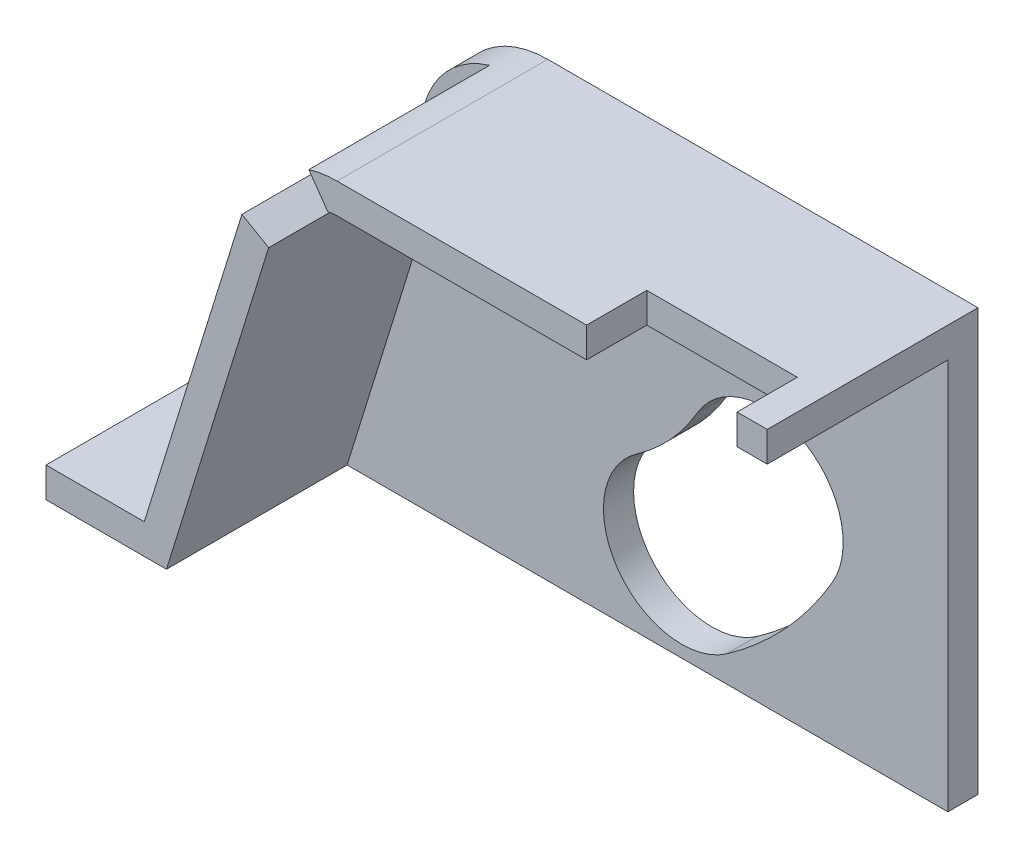
ISO-10303-21;
HEADER;
FILE_DESCRIPTION(('STEP AP214'),'2;1');
FILE_NAME('part.step','',(''),(''),'','','');
FILE_SCHEMA(('AUTOMOTIVE_DESIGN { 1 0 10303 214 1 1 1 1 }'));
ENDSEC;
DATA;
#1=APPLICATION_CONTEXT('core data for automotive mechanical design processes');
#2=APPLICATION_PROTOCOL_DEFINITION('international standard','automotive_design',2000,#1);
#3=PRODUCT_CONTEXT('',#1,'mechanical');
#4=PRODUCT('Part','Part','',(#3));
#5=PRODUCT_RELATED_PRODUCT_CATEGORY('part','',(#4));
#6=PRODUCT_DEFINITION_FORMATION('','',#4);
#7=PRODUCT_DEFINITION_CONTEXT('part definition',#1,'design');
#8=PRODUCT_DEFINITION('design','',#6,#7);
#9=PRODUCT_DEFINITION_SHAPE('','',#8);
#10=(LENGTH_UNIT() NAMED_UNIT(*) SI_UNIT(.MILLI.,.METRE.));
#11=(NAMED_UNIT(*) PLANE_ANGLE_UNIT() SI_UNIT($,.RADIAN.));
#12=(NAMED_UNIT(*) SI_UNIT($,.STERADIAN.) SOLID_ANGLE_UNIT());
#13=UNCERTAINTY_MEASURE_WITH_UNIT(LENGTH_MEASURE(1.E-05),#10,'distance_accuracy_value','');
#14=(GEOMETRIC_REPRESENTATION_CONTEXT(3) GLOBAL_UNCERTAINTY_ASSIGNED_CONTEXT((#13)) GLOBAL_UNIT_ASSIGNED_CONTEXT((#10,
#11,#12)) REPRESENTATION_CONTEXT('',''));
#15=CARTESIAN_POINT('',(0.,0.,0.));
#16=DIRECTION('',(0.,0.,1.));
#17=DIRECTION('',(1.,0.,0.));
#18=AXIS2_PLACEMENT_3D('',#15,#16,#17);
#19=CARTESIAN_POINT('',(120.,70.,-5.));
#20=DIRECTION('',(0.,-1.,0.));
#21=DIRECTION('',(1.,0.,0.));
#22=AXIS2_PLACEMENT_3D('',#19,#20,#21);
#23=PLANE('',#22);
#24=DIRECTION('',(0.,0.,1.));
#25=VECTOR('',#24,1.);
#26=CARTESIAN_POINT('',(120.,70.,-5.));
#27=LINE('',#26,#25);
#28=CARTESIAN_POINT('',(120.,70.,5.));
#29=VERTEX_POINT('',#28);
#30=CARTESIAN_POINT('',(120.,70.,40.));
#31=VERTEX_POINT('',#30);
#32=EDGE_CURVE('E338',#29,#31,#27,.T.);
#33=ORIENTED_EDGE('',*,*,#32,.F.);
#34=DIRECTION('',(1.,0.,0.));
#35=VECTOR('',#34,1.);
#36=CARTESIAN_POINT('',(0.234832876698648,70.,5.));
#37=LINE('',#36,#35);
#38=CARTESIAN_POINT('',(48.5613886077065,70.,5.));
#39=VERTEX_POINT('',#38);
#40=EDGE_CURVE('E183',#39,#29,#37,.T.);
#41=ORIENTED_EDGE('',*,*,#40,.F.);
#42=DIRECTION('',(0.,0.,1.));
#43=VECTOR('',#42,1.);
#44=CARTESIAN_POINT('',(48.5613886077065,70.,-5.));
#45=LINE('',#44,#43);
#46=CARTESIAN_POINT('',(48.5613886077065,70.,40.));
#47=VERTEX_POINT('',#46);
#48=EDGE_CURVE('E340',#39,#47,#45,.T.);
#49=ORIENTED_EDGE('',*,*,#48,.T.);
#50=DIRECTION('',(1.,0.,0.));
#51=VECTOR('',#50,1.);
#52=CARTESIAN_POINT('',(120.,70.,40.));
#53=LINE('',#52,#51);
#54=CARTESIAN_POINT('',(90.,70.,40.));
#55=VERTEX_POINT('',#54);
#56=EDGE_CURVE('E283',#47,#55,#53,.T.);
#57=ORIENTED_EDGE('',*,*,#56,.T.);
#58=DIRECTION('',(0.,0.,-1.));
#59=VECTOR('',#58,1.);
#60=CARTESIAN_POINT('',(90.,70.,40.));
#61=LINE('',#60,#59);
#62=CARTESIAN_POINT('',(90.,70.,30.));
#63=VERTEX_POINT('',#62);
#64=EDGE_CURVE('E239',#55,#63,#61,.T.);
#65=ORIENTED_EDGE('',*,*,#64,.T.);
#66=DIRECTION('',(1.,0.,0.));
#67=VECTOR('',#66,1.);
#68=CARTESIAN_POINT('',(115.,70.,30.));
#69=LINE('',#68,#67);
#70=CARTESIAN_POINT('',(115.,70.,30.));
#71=VERTEX_POINT('',#70);
#72=EDGE_CURVE('E243',#63,#71,#69,.T.);
#73=ORIENTED_EDGE('',*,*,#72,.T.);
#74=DIRECTION('',(0.,0.,1.));
#75=VECTOR('',#74,1.);
#76=CARTESIAN_POINT('',(115.,70.,40.));
#77=LINE('',#76,#75);
#78=CARTESIAN_POINT('',(115.,70.,40.));
#79=VERTEX_POINT('',#78);
#80=EDGE_CURVE('E237',#71,#79,#77,.T.);
#81=ORIENTED_EDGE('',*,*,#80,.T.);
#82=EDGE_CURVE('E281',#79,#31,#53,.T.);
#83=ORIENTED_EDGE('',*,*,#82,.T.);
#84=EDGE_LOOP('',(#33,#41,#49,#57,#65,#73,#81,#83));
#85=FACE_BOUND('',#84,.T.);
#86=ADVANCED_FACE('F33',(#85),#23,.F.);
#87=CARTESIAN_POINT('',(120.,65.,40.));
#88=DIRECTION('',(0.,-1.,0.));
#89=DIRECTION('',(0.,0.,-1.));
#90=AXIS2_PLACEMENT_3D('',#87,#88,#89);
#91=PLANE('',#90);
#92=DIRECTION('',(-1.,0.,0.));
#93=VECTOR('',#92,1.);
#94=CARTESIAN_POINT('',(120.,65.,40.));
#95=LINE('',#94,#93);
#96=CARTESIAN_POINT('',(120.,65.,40.));
#97=VERTEX_POINT('',#96);
#98=CARTESIAN_POINT('',(115.,65.,40.));
#99=VERTEX_POINT('',#98);
#100=EDGE_CURVE('E296',#97,#99,#95,.T.);
#101=ORIENTED_EDGE('',*,*,#100,.T.);
#102=DIRECTION('',(0.,0.,-1.));
#103=VECTOR('',#102,1.);
#104=CARTESIAN_POINT('',(115.,65.,40.));
#105=LINE('',#104,#103);
#106=CARTESIAN_POINT('',(115.,65.,30.));
#107=VERTEX_POINT('',#106);
#108=EDGE_CURVE('E224',#99,#107,#105,.T.);
#109=ORIENTED_EDGE('',*,*,#108,.T.);
#110=DIRECTION('',(-1.,0.,0.));
#111=VECTOR('',#110,1.);
#112=CARTESIAN_POINT('',(120.,65.,30.));
#113=LINE('',#112,#111);
#114=CARTESIAN_POINT('',(90.,65.,30.));
#115=VERTEX_POINT('',#114);
#116=EDGE_CURVE('E41',#107,#115,#113,.T.);
#117=ORIENTED_EDGE('',*,*,#116,.T.);
#118=DIRECTION('',(0.,0.,1.));
#119=VECTOR('',#118,1.);
#120=CARTESIAN_POINT('',(90.,65.,40.));
#121=LINE('',#120,#119);
#122=CARTESIAN_POINT('',(90.,65.,40.));
#123=VERTEX_POINT('',#122);
#124=EDGE_CURVE('E222',#115,#123,#121,.T.);
#125=ORIENTED_EDGE('',*,*,#124,.T.);
#126=CARTESIAN_POINT('',(48.5613886077065,65.,40.));
#127=VERTEX_POINT('',#126);
#128=EDGE_CURVE('E295',#123,#127,#95,.T.);
#129=ORIENTED_EDGE('',*,*,#128,.T.);
#130=DIRECTION('',(0.,0.,-1.));
#131=VECTOR('',#130,1.);
#132=CARTESIAN_POINT('',(48.5613886077065,65.,40.));
#133=LINE('',#132,#131);
#134=CARTESIAN_POINT('',(48.5613886077065,65.,10.));
#135=VERTEX_POINT('',#134);
#136=EDGE_CURVE('E307',#127,#135,#133,.T.);
#137=ORIENTED_EDGE('',*,*,#136,.T.);
#138=DIRECTION('',(-1.,0.,0.));
#139=VECTOR('',#138,1.);
#140=CARTESIAN_POINT('',(120.,65.,10.));
#141=LINE('',#140,#139);
#142=CARTESIAN_POINT('',(120.,65.,10.));
#143=VERTEX_POINT('',#142);
#144=EDGE_CURVE('E282',#143,#135,#141,.T.);
#145=ORIENTED_EDGE('',*,*,#144,.F.);
#146=DIRECTION('',(0.,0.,-1.));
#147=VECTOR('',#146,1.);
#148=CARTESIAN_POINT('',(120.,65.,40.));
#149=LINE('',#148,#147);
#150=EDGE_CURVE('E298',#97,#143,#149,.T.);
#151=ORIENTED_EDGE('',*,*,#150,.F.);
#152=EDGE_LOOP('',(#101,#109,#117,#125,#129,#137,#145,#151));
#153=FACE_BOUND('',#152,.T.);
#154=ADVANCED_FACE('F221',(#153),#91,.T.);
#155=CARTESIAN_POINT('',(48.5613886077065,58.9097221037272,40.));
#156=DIRECTION('',(0.,0.,-1.));
#157=DIRECTION('',(1.,0.,0.));
#158=AXIS2_PLACEMENT_3D('',#155,#156,#157);
#159=PLANE('',#158);
#160=DIRECTION('',(0.,1.,0.));
#161=VECTOR('',#160,1.);
#162=CARTESIAN_POINT('',(115.,58.9097221037273,40.));
#163=LINE('',#162,#161);
#164=EDGE_CURVE('E215',#99,#79,#163,.T.);
#165=ORIENTED_EDGE('',*,*,#164,.F.);
#166=ORIENTED_EDGE('',*,*,#100,.F.);
#167=DIRECTION('',(0.,-1.,0.));
#168=VECTOR('',#167,1.);
#169=CARTESIAN_POINT('',(120.,70.,40.));
#170=LINE('',#169,#168);
#171=EDGE_CURVE('E278',#31,#97,#170,.T.);
#172=ORIENTED_EDGE('',*,*,#171,.F.);
#173=ORIENTED_EDGE('',*,*,#82,.F.);
#174=EDGE_LOOP('',(#165,#166,#172,#173));
#175=FACE_BOUND('',#174,.T.);
#176=ADVANCED_FACE('F399',(#175),#159,.F.);
#177=DIRECTION('',(0.,-1.,0.));
#178=VECTOR('',#177,1.);
#179=CARTESIAN_POINT('',(90.,58.9097221037273,40.));
#180=LINE('',#179,#178);
#181=EDGE_CURVE('E213',#55,#123,#180,.T.);
#182=ORIENTED_EDGE('',*,*,#181,.F.);
#183=ORIENTED_EDGE('',*,*,#56,.F.);
#184=CARTESIAN_POINT('',(48.5613886077065,53.9097221037275,40.));
#185=DIRECTION('',(0.,0.,-1.));
#186=DIRECTION('',(1.,0.,0.));
#187=AXIS2_PLACEMENT_3D('',#184,#185,#186);
#188=CIRCLE('',#187,16.0902778962725);
#189=CARTESIAN_POINT('',(43.8850469520508,69.3054640962024,40.));
#190=VERTEX_POINT('',#189);
#191=EDGE_CURVE('E286',#190,#47,#188,.T.);
#192=ORIENTED_EDGE('',*,*,#191,.F.);
#193=DIRECTION('',(-0.573576436351043,0.819152044288994,0.));
#194=VECTOR('',#193,1.);
#195=CARTESIAN_POINT('',(47.0357374309038,64.8058117689672,40.));
#196=LINE('',#195,#194);
#197=CARTESIAN_POINT('',(47.0357374309038,64.8058117689672,40.));
#198=VERTEX_POINT('',#197);
#199=EDGE_CURVE('E289',#198,#190,#196,.T.);
#200=ORIENTED_EDGE('',*,*,#199,.F.);
#201=CARTESIAN_POINT('',(48.5613886077065,58.9097221037272,40.));
#202=DIRECTION('',(0.,0.,1.));
#203=DIRECTION('',(1.,0.,0.));
#204=AXIS2_PLACEMENT_3D('',#201,#202,#203);
#205=CIRCLE('',#204,6.09027789627276);
#206=EDGE_CURVE('E292',#127,#198,#205,.T.);
#207=ORIENTED_EDGE('',*,*,#206,.F.);
#208=ORIENTED_EDGE('',*,*,#128,.F.);
#209=EDGE_LOOP('',(#182,#183,#192,#200,#207,#208));
#210=FACE_BOUND('',#209,.T.);
#211=ADVANCED_FACE('F385',(#210),#159,.F.);
#212=CARTESIAN_POINT('',(33.1929152722023,58.6749157110409,-5.));
#213=DIRECTION('',(0.9551403297431,-0.296153592749172,0.));
#214=DIRECTION('',(0.296153592749172,0.9551403297431,0.));
#215=AXIS2_PLACEMENT_3D('',#212,#213,#214);
#216=PLANE('',#215);
#217=DIRECTION('',(0.,0.,1.));
#218=VECTOR('',#217,1.);
#219=CARTESIAN_POINT('',(33.1929152722023,58.6749157110409,-5.));
#220=LINE('',#219,#218);
#221=CARTESIAN_POINT('',(33.1929152722023,58.6749157110409,5.));
#222=VERTEX_POINT('',#221);
#223=CARTESIAN_POINT('',(33.1929152722023,58.6749157110409,10.));
#224=VERTEX_POINT('',#223);
#225=EDGE_CURVE('E337',#222,#224,#220,.T.);
#226=ORIENTED_EDGE('',*,*,#225,.F.);
#227=DIRECTION('',(-0.296153592749172,-0.9551403297431,0.));
#228=VECTOR('',#227,1.);
#229=CARTESIAN_POINT('',(33.1929152722023,58.6749157110409,5.));
#230=LINE('',#229,#228);
#231=CARTESIAN_POINT('',(16.5503145638758,5.,5.));
#232=VERTEX_POINT('',#231);
#233=EDGE_CURVE('E415',#222,#232,#230,.T.);
#234=ORIENTED_EDGE('',*,*,#233,.T.);
#235=DIRECTION('',(0.,0.,1.));
#236=VECTOR('',#235,1.);
#237=CARTESIAN_POINT('',(16.5503145638758,5.,-5.));
#238=LINE('',#237,#236);
#239=CARTESIAN_POINT('',(16.5503145638758,5.,40.));
#240=VERTEX_POINT('',#239);
#241=EDGE_CURVE('E334',#232,#240,#238,.T.);
#242=ORIENTED_EDGE('',*,*,#241,.T.);
#243=DIRECTION('',(0.296153592749172,0.9551403297431,0.));
#244=VECTOR('',#243,1.);
#245=CARTESIAN_POINT('',(15.,0.,40.));
#246=LINE('',#245,#244);
#247=CARTESIAN_POINT('',(32.7730020651153,57.320631822882,40.));
#248=VERTEX_POINT('',#247);
#249=EDGE_CURVE('E264',#240,#248,#246,.T.);
#250=ORIENTED_EDGE('',*,*,#249,.T.);
#251=DIRECTION('',(0.,0.,-1.));
#252=VECTOR('',#251,1.);
#253=CARTESIAN_POINT('',(32.7730020651153,57.320631822882,40.));
#254=LINE('',#253,#252);
#255=CARTESIAN_POINT('',(32.7730020651153,57.320631822882,10.));
#256=VERTEX_POINT('',#255);
#257=EDGE_CURVE('E266',#248,#256,#254,.T.);
#258=ORIENTED_EDGE('',*,*,#257,.T.);
#259=DIRECTION('',(-0.296153592749172,-0.9551403297431,0.));
#260=VECTOR('',#259,1.);
#261=CARTESIAN_POINT('',(13.6843957425264,-4.24302360349572,10.));
#262=LINE('',#261,#260);
#263=EDGE_CURVE('E204',#224,#256,#262,.T.);
#264=ORIENTED_EDGE('',*,*,#263,.F.);
#265=EDGE_LOOP('',(#226,#234,#242,#250,#258,#264));
#266=FACE_BOUND('',#265,.T.);
#267=ADVANCED_FACE('F414',(#266),#216,.F.);
#268=CARTESIAN_POINT('',(0.,0.,10.));
#269=DIRECTION('',(0.,0.,1.));
#270=DIRECTION('',(-1.,0.,0.));
#271=AXIS2_PLACEMENT_3D('',#268,#269,#270);
#272=PLANE('',#271);
#273=DIRECTION('',(-0.296153592749173,-0.9551403297431,0.));
#274=VECTOR('',#273,1.);
#275=CARTESIAN_POINT('',(37.2069506060173,54.7376581656054,10.));
#276=LINE('',#275,#274);
#277=CARTESIAN_POINT('',(37.2069506060173,54.7376581656054,10.));
#278=VERTEX_POINT('',#277);
#279=CARTESIAN_POINT('',(20.2348328766987,0.,10.));
#280=VERTEX_POINT('',#279);
#281=EDGE_CURVE('E254',#278,#280,#276,.T.);
#282=ORIENTED_EDGE('',*,*,#281,.T.);
#283=DIRECTION('',(1.,0.,0.));
#284=VECTOR('',#283,1.);
#285=CARTESIAN_POINT('',(0.,0.,10.));
#286=LINE('',#285,#284);
#287=CARTESIAN_POINT('',(120.,0.,10.));
#288=VERTEX_POINT('',#287);
#289=EDGE_CURVE('E329',#280,#288,#286,.T.);
#290=ORIENTED_EDGE('',*,*,#289,.T.);
#291=DIRECTION('',(0.,1.,0.));
#292=VECTOR('',#291,1.);
#293=CARTESIAN_POINT('',(120.,0.,10.));
#294=LINE('',#293,#292);
#295=EDGE_CURVE('E199',#288,#143,#294,.T.);
#296=ORIENTED_EDGE('',*,*,#295,.T.);
#297=ORIENTED_EDGE('',*,*,#144,.T.);
#298=CARTESIAN_POINT('',(48.5613886077065,58.9097221037272,10.));
#299=DIRECTION('',(0.,0.,1.));
#300=DIRECTION('',(1.,0.,0.));
#301=AXIS2_PLACEMENT_3D('',#298,#299,#300);
#302=CIRCLE('',#301,6.09027789627276);
#303=CARTESIAN_POINT('',(47.0357374309038,64.8058117689672,10.));
#304=VERTEX_POINT('',#303);
#305=EDGE_CURVE('E301',#135,#304,#302,.T.);
#306=ORIENTED_EDGE('',*,*,#305,.T.);
#307=DIRECTION('',(-0.573576436351043,0.819152044288994,0.));
#308=VECTOR('',#307,1.);
#309=CARTESIAN_POINT('',(47.0357374309038,64.8058117689672,10.));
#310=LINE('',#309,#308);
#311=CARTESIAN_POINT('',(43.8850469520508,69.3054640962024,10.));
#312=VERTEX_POINT('',#311);
#313=EDGE_CURVE('E277',#304,#312,#310,.T.);
#314=ORIENTED_EDGE('',*,*,#313,.T.);
#315=CARTESIAN_POINT('',(48.5613886077065,53.9097221037271,10.));
#316=DIRECTION('',(0.,0.,1.));
#317=DIRECTION('',(1.,0.,0.));
#318=AXIS2_PLACEMENT_3D('',#315,#316,#317);
#319=CIRCLE('',#318,16.0902778962729);
#320=EDGE_CURVE('E200',#312,#224,#319,.T.);
#321=ORIENTED_EDGE('',*,*,#320,.T.);
#322=ORIENTED_EDGE('',*,*,#263,.T.);
#323=DIRECTION('',(0.864075299099649,-0.503362570604781,0.));
#324=VECTOR('',#323,1.);
#325=CARTESIAN_POINT('',(37.2069506060173,54.7376581656054,10.));
#326=LINE('',#325,#324);
#327=EDGE_CURVE('E258',#256,#278,#326,.T.);
#328=ORIENTED_EDGE('',*,*,#327,.T.);
#329=EDGE_LOOP('',(#282,#290,#296,#297,#306,#314,#321,#322,#328));
#330=FACE_BOUND('',#329,.T.);
#331=CARTESIAN_POINT('',(48.5613886077065,53.9097221037271,10.));
#332=DIRECTION('',(0.,0.,1.));
#333=DIRECTION('',(1.,0.,0.));
#334=AXIS2_PLACEMENT_3D('',#331,#332,#333);
#335=CIRCLE('',#334,60.5);
#336=CARTESIAN_POINT('',(83.2627630069448,4.35102342424313,10.));
#337=VERTEX_POINT('',#336);
#338=CARTESIAN_POINT('',(100.837944203235,23.4562865821378,10.));
#339=VERTEX_POINT('',#338);
#340=EDGE_CURVE('E323',#337,#339,#335,.T.);
#341=ORIENTED_EDGE('',*,*,#340,.F.);
#342=CARTESIAN_POINT('',(75.8062693343812,15.,10.));
#343=DIRECTION('',(0.,0.,1.));
#344=DIRECTION('',(1.,0.,0.));
#345=AXIS2_PLACEMENT_3D('',#342,#343,#344);
#346=CIRCLE('',#345,13.);
#347=CARTESIAN_POINT('',(68.3497756618176,25.6489765757569,10.));
#348=VERTEX_POINT('',#347);
#349=EDGE_CURVE('E314',#348,#337,#346,.T.);
#350=ORIENTED_EDGE('',*,*,#349,.F.);
#351=CARTESIAN_POINT('',(48.5613886077065,53.9097221037271,10.));
#352=DIRECTION('',(0.,0.,-1.));
#353=DIRECTION('',(1.,0.,0.));
#354=AXIS2_PLACEMENT_3D('',#351,#352,#353);
#355=CIRCLE('',#354,34.5);
#356=CARTESIAN_POINT('',(78.3719864266444,36.5437134178622,10.));
#357=VERTEX_POINT('',#356);
#358=EDGE_CURVE('E317',#357,#348,#355,.T.);
#359=ORIENTED_EDGE('',*,*,#358,.F.);
#360=CARTESIAN_POINT('',(89.6049653149398,30.,10.));
#361=DIRECTION('',(0.,0.,1.));
#362=DIRECTION('',(1.,0.,0.));
#363=AXIS2_PLACEMENT_3D('',#360,#361,#362);
#364=CIRCLE('',#363,13.);
#365=EDGE_CURVE('E320',#339,#357,#364,.T.);
#366=ORIENTED_EDGE('',*,*,#365,.F.);
#367=EDGE_LOOP('',(#341,#350,#359,#366));
#368=FACE_BOUND('',#367,.T.);
#369=CARTESIAN_POINT('',(48.5613886077065,53.9097221037271,10.));
#370=DIRECTION('',(0.,0.,1.));
#371=DIRECTION('',(1.,0.,0.));
#372=AXIS2_PLACEMENT_3D('',#369,#370,#371);
#373=CIRCLE('',#372,2.5);
#374=CARTESIAN_POINT('',(51.0613886077065,53.9097221037271,10.));
#375=VERTEX_POINT('',#374);
#376=EDGE_CURVE('E313',#375,#375,#373,.T.);
#377=ORIENTED_EDGE('',*,*,#376,.F.);
#378=EDGE_LOOP('',(#377));
#379=FACE_BOUND('',#378,.T.);
#380=ADVANCED_FACE('F359',(#330,#368,#379),#272,.T.);
#381=CARTESIAN_POINT('',(0.,0.,5.));
#382=DIRECTION('',(0.,1.,0.));
#383=DIRECTION('',(0.,0.,1.));
#384=AXIS2_PLACEMENT_3D('',#381,#382,#383);
#385=PLANE('',#384);
#386=DIRECTION('',(0.,0.,-1.));
#387=VECTOR('',#386,1.);
#388=CARTESIAN_POINT('',(0.234832876698662,0.,5.));
#389=LINE('',#388,#387);
#390=CARTESIAN_POINT('',(0.234832876698662,0.,40.));
#391=VERTEX_POINT('',#390);
#392=CARTESIAN_POINT('',(0.234832876698662,0.,5.));
#393=VERTEX_POINT('',#392);
#394=EDGE_CURVE('E195',#391,#393,#389,.T.);
#395=ORIENTED_EDGE('',*,*,#394,.T.);
#396=DIRECTION('',(1.,0.,0.));
#397=VECTOR('',#396,1.);
#398=CARTESIAN_POINT('',(0.234832876698662,0.,5.));
#399=LINE('',#398,#397);
#400=CARTESIAN_POINT('',(120.,0.,5.));
#401=VERTEX_POINT('',#400);
#402=EDGE_CURVE('E55',#393,#401,#399,.T.);
#403=ORIENTED_EDGE('',*,*,#402,.T.);
#404=DIRECTION('',(0.,0.,-1.));
#405=VECTOR('',#404,1.);
#406=CARTESIAN_POINT('',(120.,0.,5.));
#407=LINE('',#406,#405);
#408=EDGE_CURVE('E192',#288,#401,#407,.T.);
#409=ORIENTED_EDGE('',*,*,#408,.F.);
#410=ORIENTED_EDGE('',*,*,#289,.F.);
#411=DIRECTION('',(0.,0.,-1.));
#412=VECTOR('',#411,1.);
#413=CARTESIAN_POINT('',(20.2348328766987,0.,40.));
#414=LINE('',#413,#412);
#415=CARTESIAN_POINT('',(20.2348328766987,0.,40.));
#416=VERTEX_POINT('',#415);
#417=EDGE_CURVE('E274',#416,#280,#414,.T.);
#418=ORIENTED_EDGE('',*,*,#417,.F.);
#419=DIRECTION('',(-1.,0.,0.));
#420=VECTOR('',#419,1.);
#421=CARTESIAN_POINT('',(20.2348328766987,0.,40.));
#422=LINE('',#421,#420);
#423=EDGE_CURVE('E255',#416,#391,#422,.T.);
#424=ORIENTED_EDGE('',*,*,#423,.T.);
#425=EDGE_LOOP('',(#395,#403,#409,#410,#418,#424));
#426=FACE_BOUND('',#425,.T.);
#427=ADVANCED_FACE('F35',(#426),#385,.F.);
#428=CARTESIAN_POINT('',(120.,0.,5.));
#429=DIRECTION('',(-1.,0.,0.));
#430=DIRECTION('',(0.,-1.,0.));
#431=AXIS2_PLACEMENT_3D('',#428,#429,#430);
#432=PLANE('',#431);
#433=ORIENTED_EDGE('',*,*,#408,.T.);
#434=DIRECTION('',(0.,-1.,0.));
#435=VECTOR('',#434,1.);
#436=CARTESIAN_POINT('',(120.,0.,5.));
#437=LINE('',#436,#435);
#438=EDGE_CURVE('E179',#29,#401,#437,.T.);
#439=ORIENTED_EDGE('',*,*,#438,.F.);
#440=ORIENTED_EDGE('',*,*,#32,.T.);
#441=ORIENTED_EDGE('',*,*,#171,.T.);
#442=ORIENTED_EDGE('',*,*,#150,.T.);
#443=ORIENTED_EDGE('',*,*,#295,.F.);
#444=EDGE_LOOP('',(#433,#439,#440,#441,#442,#443));
#445=FACE_BOUND('',#444,.T.);
#446=ADVANCED_FACE('F197',(#445),#432,.F.);
#447=CARTESIAN_POINT('',(48.5613886077065,53.9097221037271,0.));
#448=DIRECTION('',(0.,0.,1.));
#449=DIRECTION('',(1.,0.,0.));
#450=AXIS2_PLACEMENT_3D('',#447,#448,#449);
#451=CYLINDRICAL_SURFACE('',#450,2.5);
#452=CARTESIAN_POINT('',(48.5613886077065,53.9097221037271,5.));
#453=DIRECTION('',(0.,0.,1.));
#454=DIRECTION('',(1.,0.,0.));
#455=AXIS2_PLACEMENT_3D('',#452,#453,#454);
#456=CIRCLE('',#455,2.5);
#457=CARTESIAN_POINT('',(51.0613886077065,53.9097221037271,5.));
#458=VERTEX_POINT('',#457);
#459=EDGE_CURVE('E369',#458,#458,#456,.F.);
#460=ORIENTED_EDGE('',*,*,#459,.T.);
#461=EDGE_LOOP('',(#460));
#462=FACE_BOUND('',#461,.T.);
#463=ORIENTED_EDGE('',*,*,#376,.T.);
#464=EDGE_LOOP('',(#463));
#465=FACE_BOUND('',#464,.T.);
#466=ADVANCED_FACE('F466',(#462,#465),#451,.F.);
#467=CARTESIAN_POINT('',(75.8062693343812,15.,0.));
#468=DIRECTION('',(0.,0.,1.));
#469=DIRECTION('',(1.,0.,0.));
#470=AXIS2_PLACEMENT_3D('',#467,#468,#469);
#471=CYLINDRICAL_SURFACE('',#470,13.);
#472=DIRECTION('',(0.,0.,1.));
#473=VECTOR('',#472,1.);
#474=CARTESIAN_POINT('',(83.2627630069448,4.35102342424313,0.));
#475=LINE('',#474,#473);
#476=CARTESIAN_POINT('',(83.2627630069448,4.35102342424313,5.));
#477=VERTEX_POINT('',#476);
#478=EDGE_CURVE('E209',#477,#337,#475,.T.);
#479=ORIENTED_EDGE('',*,*,#478,.F.);
#480=CARTESIAN_POINT('',(75.8062693343812,15.,5.));
#481=DIRECTION('',(0.,0.,1.));
#482=DIRECTION('',(1.,0.,0.));
#483=AXIS2_PLACEMENT_3D('',#480,#481,#482);
#484=CIRCLE('',#483,13.);
#485=CARTESIAN_POINT('',(68.3497756618176,25.6489765757569,5.));
#486=VERTEX_POINT('',#485);
#487=EDGE_CURVE('E48',#477,#486,#484,.F.);
#488=ORIENTED_EDGE('',*,*,#487,.T.);
#489=DIRECTION('',(0.,0.,1.));
#490=VECTOR('',#489,1.);
#491=CARTESIAN_POINT('',(68.3497756618176,25.6489765757569,0.));
#492=LINE('',#491,#490);
#493=EDGE_CURVE('E201',#486,#348,#492,.T.);
#494=ORIENTED_EDGE('',*,*,#493,.T.);
#495=ORIENTED_EDGE('',*,*,#349,.T.);
#496=EDGE_LOOP('',(#479,#488,#494,#495));
#497=FACE_BOUND('',#496,.T.);
#498=ADVANCED_FACE('F355',(#497),#471,.F.);
#499=CARTESIAN_POINT('',(48.5613886077065,53.9097221037271,0.));
#500=DIRECTION('',(0.,0.,1.));
#501=DIRECTION('',(1.,0.,0.));
#502=AXIS2_PLACEMENT_3D('',#499,#500,#501);
#503=CYLINDRICAL_SURFACE('',#502,34.5);
#504=ORIENTED_EDGE('',*,*,#493,.F.);
#505=CARTESIAN_POINT('',(48.5613886077065,53.9097221037271,5.));
#506=DIRECTION('',(0.,0.,1.));
#507=DIRECTION('',(1.,0.,0.));
#508=AXIS2_PLACEMENT_3D('',#505,#506,#507);
#509=CIRCLE('',#508,34.5);
#510=CARTESIAN_POINT('',(78.3719864266444,36.5437134178622,5.));
#511=VERTEX_POINT('',#510);
#512=EDGE_CURVE('E367',#486,#511,#509,.T.);
#513=ORIENTED_EDGE('',*,*,#512,.T.);
#514=DIRECTION('',(0.,0.,1.));
#515=VECTOR('',#514,1.);
#516=CARTESIAN_POINT('',(78.3719864266444,36.5437134178622,0.));
#517=LINE('',#516,#515);
#518=EDGE_CURVE('E206',#511,#357,#517,.T.);
#519=ORIENTED_EDGE('',*,*,#518,.T.);
#520=ORIENTED_EDGE('',*,*,#358,.T.);
#521=EDGE_LOOP('',(#504,#513,#519,#520));
#522=FACE_BOUND('',#521,.T.);
#523=ADVANCED_FACE('F366',(#522),#503,.T.);
#524=CARTESIAN_POINT('',(89.6049653149398,30.,0.));
#525=DIRECTION('',(0.,0.,1.));
#526=DIRECTION('',(1.,0.,0.));
#527=AXIS2_PLACEMENT_3D('',#524,#525,#526);
#528=CYLINDRICAL_SURFACE('',#527,13.);
#529=ORIENTED_EDGE('',*,*,#518,.F.);
#530=CARTESIAN_POINT('',(89.6049653149398,30.,5.));
#531=DIRECTION('',(0.,0.,1.));
#532=DIRECTION('',(1.,0.,0.));
#533=AXIS2_PLACEMENT_3D('',#530,#531,#532);
#534=CIRCLE('',#533,13.);
#535=CARTESIAN_POINT('',(100.837944203235,23.4562865821378,5.));
#536=VERTEX_POINT('',#535);
#537=EDGE_CURVE('E363',#511,#536,#534,.F.);
#538=ORIENTED_EDGE('',*,*,#537,.T.);
#539=DIRECTION('',(0.,0.,1.));
#540=VECTOR('',#539,1.);
#541=CARTESIAN_POINT('',(100.837944203235,23.4562865821378,0.));
#542=LINE('',#541,#540);
#543=EDGE_CURVE('E343',#536,#339,#542,.T.);
#544=ORIENTED_EDGE('',*,*,#543,.T.);
#545=ORIENTED_EDGE('',*,*,#365,.T.);
#546=EDGE_LOOP('',(#529,#538,#544,#545));
#547=FACE_BOUND('',#546,.T.);
#548=ADVANCED_FACE('F362',(#547),#528,.F.);
#549=CARTESIAN_POINT('',(48.5613886077065,53.9097221037271,0.));
#550=DIRECTION('',(0.,0.,1.));
#551=DIRECTION('',(1.,0.,0.));
#552=AXIS2_PLACEMENT_3D('',#549,#550,#551);
#553=CYLINDRICAL_SURFACE('',#552,60.5);
#554=ORIENTED_EDGE('',*,*,#543,.F.);
#555=CARTESIAN_POINT('',(48.5613886077065,53.9097221037271,5.));
#556=DIRECTION('',(0.,0.,1.));
#557=DIRECTION('',(1.,0.,0.));
#558=AXIS2_PLACEMENT_3D('',#555,#556,#557);
#559=CIRCLE('',#558,60.5);
#560=EDGE_CURVE('E352',#536,#477,#559,.F.);
#561=ORIENTED_EDGE('',*,*,#560,.T.);
#562=ORIENTED_EDGE('',*,*,#478,.T.);
#563=ORIENTED_EDGE('',*,*,#340,.T.);
#564=EDGE_LOOP('',(#554,#561,#562,#563));
#565=FACE_BOUND('',#564,.T.);
#566=ADVANCED_FACE('F349',(#565),#553,.F.);
#567=CARTESIAN_POINT('',(48.5613886077065,53.9097221037271,-5.));
#568=DIRECTION('',(0.,0.,1.));
#569=DIRECTION('',(1.,0.,0.));
#570=AXIS2_PLACEMENT_3D('',#567,#568,#569);
#571=CYLINDRICAL_SURFACE('',#570,16.0902778962729);
#572=ORIENTED_EDGE('',*,*,#48,.F.);
#573=CARTESIAN_POINT('',(48.5613886077065,53.9097221037271,5.));
#574=DIRECTION('',(0.,0.,1.));
#575=DIRECTION('',(1.,0.,0.));
#576=AXIS2_PLACEMENT_3D('',#573,#574,#575);
#577=CIRCLE('',#576,16.0902778962729);
#578=EDGE_CURVE('E406',#39,#222,#577,.T.);
#579=ORIENTED_EDGE('',*,*,#578,.T.);
#580=ORIENTED_EDGE('',*,*,#225,.T.);
#581=ORIENTED_EDGE('',*,*,#320,.F.);
#582=DIRECTION('',(0.,0.,-1.));
#583=VECTOR('',#582,1.);
#584=CARTESIAN_POINT('',(43.8850469520508,69.3054640962024,40.));
#585=LINE('',#584,#583);
#586=EDGE_CURVE('E311',#190,#312,#585,.T.);
#587=ORIENTED_EDGE('',*,*,#586,.F.);
#588=ORIENTED_EDGE('',*,*,#191,.T.);
#589=EDGE_LOOP('',(#572,#579,#580,#581,#587,#588));
#590=FACE_BOUND('',#589,.T.);
#591=ADVANCED_FACE('F405',(#590),#571,.T.);
#592=CARTESIAN_POINT('',(20.2348328766987,5.,5.));
#593=DIRECTION('',(0.,1.,0.));
#594=DIRECTION('',(0.,0.,1.));
#595=AXIS2_PLACEMENT_3D('',#592,#593,#594);
#596=PLANE('',#595);
#597=DIRECTION('',(1.,0.,0.));
#598=VECTOR('',#597,1.);
#599=CARTESIAN_POINT('',(20.2348328766987,5.,5.));
#600=LINE('',#599,#598);
#601=CARTESIAN_POINT('',(0.234832876698661,5.,5.));
#602=VERTEX_POINT('',#601);
#603=EDGE_CURVE('E401',#602,#232,#600,.T.);
#604=ORIENTED_EDGE('',*,*,#603,.F.);
#605=DIRECTION('',(0.,0.,-1.));
#606=VECTOR('',#605,1.);
#607=CARTESIAN_POINT('',(0.234832876698662,5.,5.));
#608=LINE('',#607,#606);
#609=CARTESIAN_POINT('',(0.234832876698662,5.,40.));
#610=VERTEX_POINT('',#609);
#611=EDGE_CURVE('E331',#610,#602,#608,.T.);
#612=ORIENTED_EDGE('',*,*,#611,.F.);
#613=DIRECTION('',(1.,0.,0.));
#614=VECTOR('',#613,1.);
#615=CARTESIAN_POINT('',(20.2348328766987,5.,40.));
#616=LINE('',#615,#614);
#617=EDGE_CURVE('E248',#610,#240,#616,.T.);
#618=ORIENTED_EDGE('',*,*,#617,.T.);
#619=ORIENTED_EDGE('',*,*,#241,.F.);
#620=EDGE_LOOP('',(#604,#612,#618,#619));
#621=FACE_BOUND('',#620,.T.);
#622=ADVANCED_FACE('F436',(#621),#596,.T.);
#623=CARTESIAN_POINT('',(0.234832876698662,0.,5.));
#624=DIRECTION('',(-1.,0.,0.));
#625=DIRECTION('',(0.,0.,1.));
#626=AXIS2_PLACEMENT_3D('',#623,#624,#625);
#627=PLANE('',#626);
#628=DIRECTION('',(0.,1.,0.));
#629=VECTOR('',#628,1.);
#630=CARTESIAN_POINT('',(0.234832876698662,0.,5.));
#631=LINE('',#630,#629);
#632=EDGE_CURVE('E11',#393,#602,#631,.T.);
#633=ORIENTED_EDGE('',*,*,#632,.F.);
#634=ORIENTED_EDGE('',*,*,#394,.F.);
#635=DIRECTION('',(0.,1.,0.));
#636=VECTOR('',#635,1.);
#637=CARTESIAN_POINT('',(0.234832876698662,0.,40.));
#638=LINE('',#637,#636);
#639=EDGE_CURVE('E251',#391,#610,#638,.T.);
#640=ORIENTED_EDGE('',*,*,#639,.T.);
#641=ORIENTED_EDGE('',*,*,#611,.T.);
#642=EDGE_LOOP('',(#633,#634,#640,#641));
#643=FACE_BOUND('',#642,.T.);
#644=ADVANCED_FACE('F433',(#643),#627,.T.);
#645=CARTESIAN_POINT('',(47.0357374309038,64.8058117689672,40.));
#646=DIRECTION('',(-0.819152044288994,-0.573576436351043,0.));
#647=DIRECTION('',(0.573576436351043,-0.819152044288994,0.));
#648=AXIS2_PLACEMENT_3D('',#645,#646,#647);
#649=PLANE('',#648);
#650=ORIENTED_EDGE('',*,*,#313,.F.);
#651=DIRECTION('',(0.,0.,-1.));
#652=VECTOR('',#651,1.);
#653=CARTESIAN_POINT('',(47.0357374309038,64.8058117689672,40.));
#654=LINE('',#653,#652);
#655=EDGE_CURVE('E309',#198,#304,#654,.T.);
#656=ORIENTED_EDGE('',*,*,#655,.F.);
#657=ORIENTED_EDGE('',*,*,#199,.T.);
#658=ORIENTED_EDGE('',*,*,#586,.T.);
#659=EDGE_LOOP('',(#650,#656,#657,#658));
#660=FACE_BOUND('',#659,.T.);
#661=ADVANCED_FACE('F410',(#660),#649,.T.);
#662=CARTESIAN_POINT('',(48.5613886077065,58.9097221037272,40.));
#663=DIRECTION('',(0.,0.,-1.));
#664=DIRECTION('',(-1.,0.,0.));
#665=AXIS2_PLACEMENT_3D('',#662,#663,#664);
#666=CYLINDRICAL_SURFACE('',#665,6.09027789627276);
#667=ORIENTED_EDGE('',*,*,#305,.F.);
#668=ORIENTED_EDGE('',*,*,#136,.F.);
#669=ORIENTED_EDGE('',*,*,#206,.T.);
#670=ORIENTED_EDGE('',*,*,#655,.T.);
#671=EDGE_LOOP('',(#667,#668,#669,#670));
#672=FACE_BOUND('',#671,.T.);
#673=ADVANCED_FACE('F393',(#672),#666,.F.);
#674=CARTESIAN_POINT('',(37.2069506060173,54.7376581656054,40.));
#675=DIRECTION('',(0.9551403297431,-0.296153592749172,0.));
#676=DIRECTION('',(0.296153592749173,0.9551403297431,0.));
#677=AXIS2_PLACEMENT_3D('',#674,#675,#676);
#678=PLANE('',#677);
#679=ORIENTED_EDGE('',*,*,#281,.F.);
#680=DIRECTION('',(0.,0.,-1.));
#681=VECTOR('',#680,1.);
#682=CARTESIAN_POINT('',(37.2069506060173,54.7376581656054,40.));
#683=LINE('',#682,#681);
#684=CARTESIAN_POINT('',(37.2069506060173,54.7376581656054,40.));
#685=VERTEX_POINT('',#684);
#686=EDGE_CURVE('E271',#685,#278,#683,.T.);
#687=ORIENTED_EDGE('',*,*,#686,.F.);
#688=DIRECTION('',(-0.296153592749173,-0.9551403297431,0.));
#689=VECTOR('',#688,1.);
#690=CARTESIAN_POINT('',(37.2069506060173,54.7376581656054,40.));
#691=LINE('',#690,#689);
#692=EDGE_CURVE('E257',#685,#416,#691,.T.);
#693=ORIENTED_EDGE('',*,*,#692,.T.);
#694=ORIENTED_EDGE('',*,*,#417,.T.);
#695=EDGE_LOOP('',(#679,#687,#693,#694));
#696=FACE_BOUND('',#695,.T.);
#697=ADVANCED_FACE('F425',(#696),#678,.T.);
#698=CARTESIAN_POINT('',(37.2069506060173,54.7376581656054,40.));
#699=DIRECTION('',(0.503362570604781,0.864075299099649,0.));
#700=DIRECTION('',(-0.864075299099649,0.503362570604781,0.));
#701=AXIS2_PLACEMENT_3D('',#698,#699,#700);
#702=PLANE('',#701);
#703=ORIENTED_EDGE('',*,*,#327,.F.);
#704=ORIENTED_EDGE('',*,*,#257,.F.);
#705=DIRECTION('',(0.864075299099649,-0.503362570604781,0.));
#706=VECTOR('',#705,1.);
#707=CARTESIAN_POINT('',(37.2069506060173,54.7376581656054,40.));
#708=LINE('',#707,#706);
#709=EDGE_CURVE('E261',#248,#685,#708,.T.);
#710=ORIENTED_EDGE('',*,*,#709,.T.);
#711=ORIENTED_EDGE('',*,*,#686,.T.);
#712=EDGE_LOOP('',(#703,#704,#710,#711));
#713=FACE_BOUND('',#712,.T.);
#714=ADVANCED_FACE('F421',(#713),#702,.T.);
#715=CARTESIAN_POINT('',(0.,0.,40.));
#716=DIRECTION('',(0.,0.,1.));
#717=DIRECTION('',(-1.,0.,0.));
#718=AXIS2_PLACEMENT_3D('',#715,#716,#717);
#719=PLANE('',#718);
#720=ORIENTED_EDGE('',*,*,#423,.F.);
#721=ORIENTED_EDGE('',*,*,#692,.F.);
#722=ORIENTED_EDGE('',*,*,#709,.F.);
#723=ORIENTED_EDGE('',*,*,#249,.F.);
#724=ORIENTED_EDGE('',*,*,#617,.F.);
#725=ORIENTED_EDGE('',*,*,#639,.F.);
#726=EDGE_LOOP('',(#720,#721,#722,#723,#724,#725));
#727=FACE_BOUND('',#726,.T.);
#728=ADVANCED_FACE('F429',(#727),#719,.T.);
#729=CARTESIAN_POINT('',(115.,0.,40.));
#730=DIRECTION('',(-1.,0.,0.));
#731=DIRECTION('',(0.,-1.,0.));
#732=AXIS2_PLACEMENT_3D('',#729,#730,#731);
#733=PLANE('',#732);
#734=ORIENTED_EDGE('',*,*,#164,.T.);
#735=ORIENTED_EDGE('',*,*,#80,.F.);
#736=DIRECTION('',(0.,1.,0.));
#737=VECTOR('',#736,1.);
#738=CARTESIAN_POINT('',(115.,0.,30.));
#739=LINE('',#738,#737);
#740=EDGE_CURVE('E230',#107,#71,#739,.T.);
#741=ORIENTED_EDGE('',*,*,#740,.F.);
#742=ORIENTED_EDGE('',*,*,#108,.F.);
#743=EDGE_LOOP('',(#734,#735,#741,#742));
#744=FACE_BOUND('',#743,.T.);
#745=ADVANCED_FACE('F234',(#744),#733,.T.);
#746=CARTESIAN_POINT('',(90.,0.,40.));
#747=DIRECTION('',(1.,0.,0.));
#748=DIRECTION('',(0.,1.,0.));
#749=AXIS2_PLACEMENT_3D('',#746,#747,#748);
#750=PLANE('',#749);
#751=DIRECTION('',(0.,1.,0.));
#752=VECTOR('',#751,1.);
#753=CARTESIAN_POINT('',(90.,0.,30.));
#754=LINE('',#753,#752);
#755=EDGE_CURVE('E232',#115,#63,#754,.T.);
#756=ORIENTED_EDGE('',*,*,#755,.T.);
#757=ORIENTED_EDGE('',*,*,#64,.F.);
#758=ORIENTED_EDGE('',*,*,#181,.T.);
#759=ORIENTED_EDGE('',*,*,#124,.F.);
#760=EDGE_LOOP('',(#756,#757,#758,#759));
#761=FACE_BOUND('',#760,.T.);
#762=ADVANCED_FACE('F383',(#761),#750,.T.);
#763=CARTESIAN_POINT('',(115.,0.,30.));
#764=DIRECTION('',(0.,0.,1.));
#765=DIRECTION('',(1.,0.,0.));
#766=AXIS2_PLACEMENT_3D('',#763,#764,#765);
#767=PLANE('',#766);
#768=ORIENTED_EDGE('',*,*,#740,.T.);
#769=ORIENTED_EDGE('',*,*,#72,.F.);
#770=ORIENTED_EDGE('',*,*,#755,.F.);
#771=ORIENTED_EDGE('',*,*,#116,.F.);
#772=EDGE_LOOP('',(#768,#769,#770,#771));
#773=FACE_BOUND('',#772,.T.);
#774=ADVANCED_FACE('F228',(#773),#767,.T.);
#775=CARTESIAN_POINT('',(0.234832876698662,0.,5.));
#776=DIRECTION('',(0.,0.,1.));
#777=DIRECTION('',(1.,0.,0.));
#778=AXIS2_PLACEMENT_3D('',#775,#776,#777);
#779=PLANE('',#778);
#780=ORIENTED_EDGE('',*,*,#560,.F.);
#781=ORIENTED_EDGE('',*,*,#537,.F.);
#782=ORIENTED_EDGE('',*,*,#512,.F.);
#783=ORIENTED_EDGE('',*,*,#487,.F.);
#784=EDGE_LOOP('',(#780,#781,#782,#783));
#785=FACE_BOUND('',#784,.T.);
#786=ORIENTED_EDGE('',*,*,#40,.T.);
#787=ORIENTED_EDGE('',*,*,#438,.T.);
#788=ORIENTED_EDGE('',*,*,#402,.F.);
#789=ORIENTED_EDGE('',*,*,#632,.T.);
#790=ORIENTED_EDGE('',*,*,#603,.T.);
#791=ORIENTED_EDGE('',*,*,#233,.F.);
#792=ORIENTED_EDGE('',*,*,#578,.F.);
#793=EDGE_LOOP('',(#786,#787,#788,#789,#790,#791,#792));
#794=FACE_BOUND('',#793,.T.);
#795=ORIENTED_EDGE('',*,*,#459,.F.);
#796=EDGE_LOOP('',(#795));
#797=FACE_BOUND('',#796,.T.);
#798=ADVANCED_FACE('F180',(#785,#794,#797),#779,.F.);
#799=CLOSED_SHELL('',(#86,#154,#176,#211,#267,#380,#427,#446,#466,#498,#523,#548,#566,#591,#622,
#644,#661,#673,#697,#714,#728,#745,#762,#774,#798));
#800=MANIFOLD_SOLID_BREP('B2',#799);
#801=ADVANCED_BREP_SHAPE_REPRESENTATION('',(#18,#800),#14);
#802=SHAPE_DEFINITION_REPRESENTATION(#9,#801);
ENDSEC;
END-ISO-10303-21;
